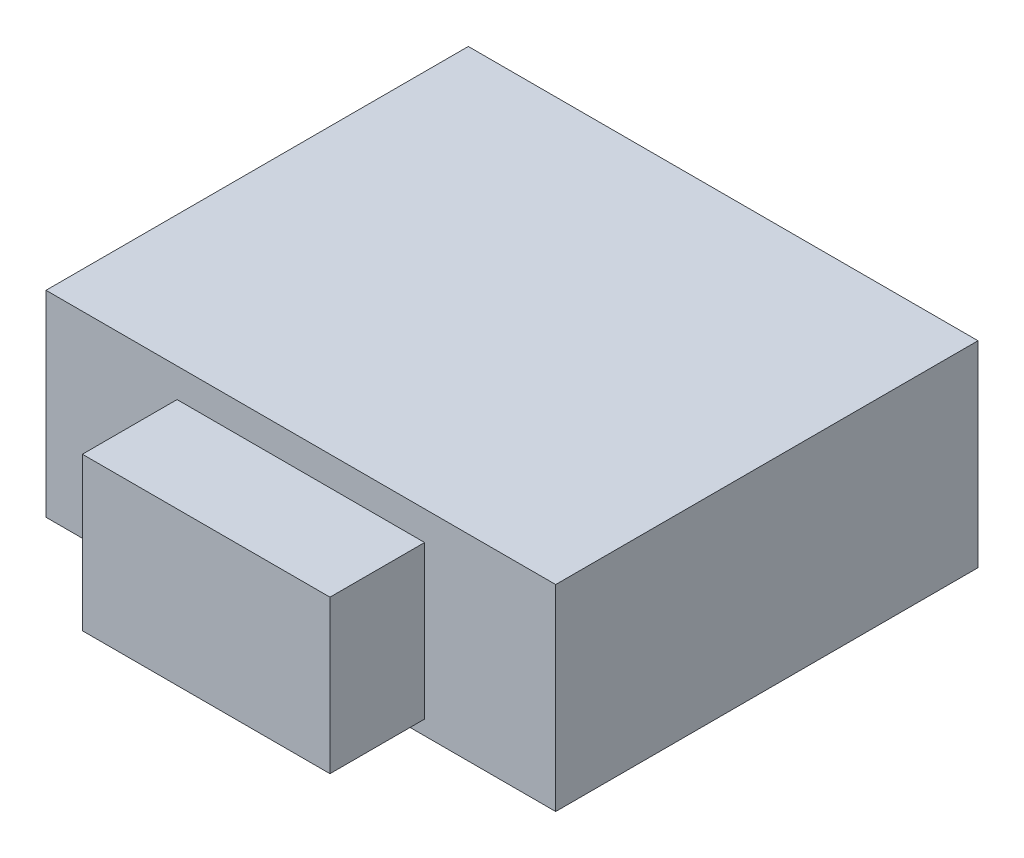
ISO-10303-21;
HEADER;
FILE_DESCRIPTION(('STEP AP214'),'2;1');
FILE_NAME('part.step','',(''),(''),'','','');
FILE_SCHEMA(('AUTOMOTIVE_DESIGN { 1 0 10303 214 1 1 1 1 }'));
ENDSEC;
DATA;
#1=APPLICATION_CONTEXT('core data for automotive mechanical design processes');
#2=APPLICATION_PROTOCOL_DEFINITION('international standard','automotive_design',2000,#1);
#3=PRODUCT_CONTEXT('',#1,'mechanical');
#4=PRODUCT('Part','Part','',(#3));
#5=PRODUCT_RELATED_PRODUCT_CATEGORY('part','',(#4));
#6=PRODUCT_DEFINITION_FORMATION('','',#4);
#7=PRODUCT_DEFINITION_CONTEXT('part definition',#1,'design');
#8=PRODUCT_DEFINITION('design','',#6,#7);
#9=PRODUCT_DEFINITION_SHAPE('','',#8);
#10=(LENGTH_UNIT() NAMED_UNIT(*) SI_UNIT(.MILLI.,.METRE.));
#11=(NAMED_UNIT(*) PLANE_ANGLE_UNIT() SI_UNIT($,.RADIAN.));
#12=(NAMED_UNIT(*) SI_UNIT($,.STERADIAN.) SOLID_ANGLE_UNIT());
#13=UNCERTAINTY_MEASURE_WITH_UNIT(LENGTH_MEASURE(1.E-05),#10,'distance_accuracy_value','');
#14=(GEOMETRIC_REPRESENTATION_CONTEXT(3) GLOBAL_UNCERTAINTY_ASSIGNED_CONTEXT((#13)) GLOBAL_UNIT_ASSIGNED_CONTEXT((#10,
#11,#12)) REPRESENTATION_CONTEXT('',''));
#15=CARTESIAN_POINT('',(0.,0.,0.));
#16=DIRECTION('',(0.,0.,1.));
#17=DIRECTION('',(1.,0.,0.));
#18=AXIS2_PLACEMENT_3D('',#15,#16,#17);
#19=CARTESIAN_POINT('',(0.,0.,0.));
#20=DIRECTION('',(0.,0.,1.));
#21=DIRECTION('',(1.,0.,0.));
#22=AXIS2_PLACEMENT_3D('',#19,#20,#21);
#23=PLANE('',#22);
#24=DIRECTION('',(0.,1.,0.));
#25=VECTOR('',#24,1.);
#26=CARTESIAN_POINT('',(-1.75,0.,0.));
#27=LINE('',#26,#25);
#28=CARTESIAN_POINT('',(-1.75,-1.34999999999999,0.));
#29=VERTEX_POINT('',#28);
#30=CARTESIAN_POINT('',(-1.75,0.,0.));
#31=VERTEX_POINT('',#30);
#32=EDGE_CURVE('E132',#29,#31,#27,.T.);
#33=ORIENTED_EDGE('',*,*,#32,.F.);
#34=DIRECTION('',(-1.,0.,0.));
#35=VECTOR('',#34,1.);
#36=CARTESIAN_POINT('',(-1.75,-1.34999999999999,0.));
#37=LINE('',#36,#35);
#38=CARTESIAN_POINT('',(1.75,-1.34999999999999,0.));
#39=VERTEX_POINT('',#38);
#40=EDGE_CURVE('E78',#39,#29,#37,.T.);
#41=ORIENTED_EDGE('',*,*,#40,.F.);
#42=DIRECTION('',(0.,-1.,0.));
#43=VECTOR('',#42,1.);
#44=CARTESIAN_POINT('',(1.75,0.,0.));
#45=LINE('',#44,#43);
#46=CARTESIAN_POINT('',(1.75,0.,0.));
#47=VERTEX_POINT('',#46);
#48=EDGE_CURVE('E148',#47,#39,#45,.T.);
#49=ORIENTED_EDGE('',*,*,#48,.F.);
#50=DIRECTION('',(1.,0.,0.));
#51=VECTOR('',#50,1.);
#52=CARTESIAN_POINT('',(-1.75,0.,0.));
#53=LINE('',#52,#51);
#54=EDGE_CURVE('E135',#31,#47,#53,.T.);
#55=ORIENTED_EDGE('',*,*,#54,.F.);
#56=EDGE_LOOP('',(#33,#41,#49,#55));
#57=FACE_BOUND('',#56,.T.);
#58=DIRECTION('',(1.,0.,0.));
#59=VECTOR('',#58,1.);
#60=CARTESIAN_POINT('',(0.85,-1.24999999999999,0.));
#61=LINE('',#60,#59);
#62=CARTESIAN_POINT('',(-0.85,-1.24999999999999,0.));
#63=VERTEX_POINT('',#62);
#64=CARTESIAN_POINT('',(0.85,-1.24999999999999,0.));
#65=VERTEX_POINT('',#64);
#66=EDGE_CURVE('E263',#63,#65,#61,.T.);
#67=ORIENTED_EDGE('',*,*,#66,.F.);
#68=DIRECTION('',(0.,-1.,0.));
#69=VECTOR('',#68,1.);
#70=CARTESIAN_POINT('',(-0.85,-1.24999999999999,0.));
#71=LINE('',#70,#69);
#72=CARTESIAN_POINT('',(-0.85,-0.199999999999992,0.));
#73=VERTEX_POINT('',#72);
#74=EDGE_CURVE('E130',#73,#63,#71,.T.);
#75=ORIENTED_EDGE('',*,*,#74,.F.);
#76=DIRECTION('',(-1.,0.,0.));
#77=VECTOR('',#76,1.);
#78=CARTESIAN_POINT('',(0.85,-0.199999999999992,0.));
#79=LINE('',#78,#77);
#80=CARTESIAN_POINT('',(0.85,-0.199999999999992,0.));
#81=VERTEX_POINT('',#80);
#82=EDGE_CURVE('E126',#81,#73,#79,.T.);
#83=ORIENTED_EDGE('',*,*,#82,.F.);
#84=DIRECTION('',(0.,1.,0.));
#85=VECTOR('',#84,1.);
#86=CARTESIAN_POINT('',(0.85,-1.24999999999999,0.));
#87=LINE('',#86,#85);
#88=EDGE_CURVE('E260',#65,#81,#87,.T.);
#89=ORIENTED_EDGE('',*,*,#88,.F.);
#90=EDGE_LOOP('',(#67,#75,#83,#89));
#91=FACE_BOUND('',#90,.T.);
#92=ADVANCED_FACE('F33',(#57,#91),#23,.T.);
#93=CARTESIAN_POINT('',(-1.75,0.,-2.9));
#94=DIRECTION('',(1.,0.,0.));
#95=DIRECTION('',(0.,0.,-1.));
#96=AXIS2_PLACEMENT_3D('',#93,#94,#95);
#97=PLANE('',#96);
#98=ORIENTED_EDGE('',*,*,#32,.T.);
#99=DIRECTION('',(0.,0.,1.));
#100=VECTOR('',#99,1.);
#101=CARTESIAN_POINT('',(-1.75,0.,-2.9));
#102=LINE('',#101,#100);
#103=CARTESIAN_POINT('',(-1.75,0.,-2.9));
#104=VERTEX_POINT('',#103);
#105=EDGE_CURVE('E11',#104,#31,#102,.T.);
#106=ORIENTED_EDGE('',*,*,#105,.F.);
#107=DIRECTION('',(0.,1.,0.));
#108=VECTOR('',#107,1.);
#109=CARTESIAN_POINT('',(-1.75,0.,-2.9));
#110=LINE('',#109,#108);
#111=CARTESIAN_POINT('',(-1.75,-1.34999999999999,-2.9));
#112=VERTEX_POINT('',#111);
#113=EDGE_CURVE('E140',#112,#104,#110,.T.);
#114=ORIENTED_EDGE('',*,*,#113,.F.);
#115=DIRECTION('',(0.,0.,1.));
#116=VECTOR('',#115,1.);
#117=CARTESIAN_POINT('',(-1.75,-1.34999999999999,-2.9));
#118=LINE('',#117,#116);
#119=EDGE_CURVE('E145',#112,#29,#118,.T.);
#120=ORIENTED_EDGE('',*,*,#119,.T.);
#121=EDGE_LOOP('',(#98,#106,#114,#120));
#122=FACE_BOUND('',#121,.T.);
#123=ADVANCED_FACE('F35',(#122),#97,.F.);
#124=CARTESIAN_POINT('',(-1.75,0.,-2.9));
#125=DIRECTION('',(0.,-1.,0.));
#126=DIRECTION('',(0.,0.,-1.));
#127=AXIS2_PLACEMENT_3D('',#124,#125,#126);
#128=PLANE('',#127);
#129=ORIENTED_EDGE('',*,*,#54,.T.);
#130=DIRECTION('',(0.,0.,1.));
#131=VECTOR('',#130,1.);
#132=CARTESIAN_POINT('',(1.75,0.,-2.9));
#133=LINE('',#132,#131);
#134=CARTESIAN_POINT('',(1.75,0.,-2.9));
#135=VERTEX_POINT('',#134);
#136=EDGE_CURVE('E41',#135,#47,#133,.T.);
#137=ORIENTED_EDGE('',*,*,#136,.F.);
#138=DIRECTION('',(1.,0.,0.));
#139=VECTOR('',#138,1.);
#140=CARTESIAN_POINT('',(-1.75,0.,-2.9));
#141=LINE('',#140,#139);
#142=EDGE_CURVE('E85',#104,#135,#141,.T.);
#143=ORIENTED_EDGE('',*,*,#142,.F.);
#144=ORIENTED_EDGE('',*,*,#105,.T.);
#145=EDGE_LOOP('',(#129,#137,#143,#144));
#146=FACE_BOUND('',#145,.T.);
#147=ADVANCED_FACE('F174',(#146),#128,.F.);
#148=CARTESIAN_POINT('',(1.75,0.,-2.9));
#149=DIRECTION('',(-1.,0.,0.));
#150=DIRECTION('',(0.,-1.,0.));
#151=AXIS2_PLACEMENT_3D('',#148,#149,#150);
#152=PLANE('',#151);
#153=ORIENTED_EDGE('',*,*,#48,.T.);
#154=DIRECTION('',(0.,0.,1.));
#155=VECTOR('',#154,1.);
#156=CARTESIAN_POINT('',(1.75,-1.34999999999999,-2.9));
#157=LINE('',#156,#155);
#158=CARTESIAN_POINT('',(1.75,-1.34999999999999,-2.9));
#159=VERTEX_POINT('',#158);
#160=EDGE_CURVE('E152',#159,#39,#157,.T.);
#161=ORIENTED_EDGE('',*,*,#160,.F.);
#162=DIRECTION('',(0.,-1.,0.));
#163=VECTOR('',#162,1.);
#164=CARTESIAN_POINT('',(1.75,0.,-2.9));
#165=LINE('',#164,#163);
#166=EDGE_CURVE('E143',#135,#159,#165,.T.);
#167=ORIENTED_EDGE('',*,*,#166,.F.);
#168=ORIENTED_EDGE('',*,*,#136,.T.);
#169=EDGE_LOOP('',(#153,#161,#167,#168));
#170=FACE_BOUND('',#169,.T.);
#171=ADVANCED_FACE('F157',(#170),#152,.F.);
#172=CARTESIAN_POINT('',(-1.75,-1.34999999999999,-2.9));
#173=DIRECTION('',(0.,1.,0.));
#174=DIRECTION('',(0.,0.,1.));
#175=AXIS2_PLACEMENT_3D('',#172,#173,#174);
#176=PLANE('',#175);
#177=ORIENTED_EDGE('',*,*,#40,.T.);
#178=ORIENTED_EDGE('',*,*,#119,.F.);
#179=DIRECTION('',(-1.,0.,0.));
#180=VECTOR('',#179,1.);
#181=CARTESIAN_POINT('',(-1.75,-1.34999999999999,-2.9));
#182=LINE('',#181,#180);
#183=EDGE_CURVE('E57',#159,#112,#182,.T.);
#184=ORIENTED_EDGE('',*,*,#183,.F.);
#185=ORIENTED_EDGE('',*,*,#160,.T.);
#186=EDGE_LOOP('',(#177,#178,#184,#185));
#187=FACE_BOUND('',#186,.T.);
#188=ADVANCED_FACE('F165',(#187),#176,.F.);
#189=CARTESIAN_POINT('',(0.,0.,-2.9));
#190=DIRECTION('',(0.,0.,1.));
#191=DIRECTION('',(1.,0.,0.));
#192=AXIS2_PLACEMENT_3D('',#189,#190,#191);
#193=PLANE('',#192);
#194=ORIENTED_EDGE('',*,*,#113,.T.);
#195=ORIENTED_EDGE('',*,*,#142,.T.);
#196=ORIENTED_EDGE('',*,*,#166,.T.);
#197=ORIENTED_EDGE('',*,*,#183,.T.);
#198=EDGE_LOOP('',(#194,#195,#196,#197));
#199=FACE_BOUND('',#198,.T.);
#200=ADVANCED_FACE('F167',(#199),#193,.F.);
#201=CARTESIAN_POINT('',(-0.85,-1.24999999999999,0.65));
#202=DIRECTION('',(1.,0.,0.));
#203=DIRECTION('',(0.,0.,-1.));
#204=AXIS2_PLACEMENT_3D('',#201,#202,#203);
#205=PLANE('',#204);
#206=ORIENTED_EDGE('',*,*,#74,.T.);
#207=DIRECTION('',(0.,0.,-1.));
#208=VECTOR('',#207,1.);
#209=CARTESIAN_POINT('',(-0.85,-1.24999999999999,0.65));
#210=LINE('',#209,#208);
#211=CARTESIAN_POINT('',(-0.85,-1.24999999999999,0.65));
#212=VERTEX_POINT('',#211);
#213=EDGE_CURVE('E111',#212,#63,#210,.T.);
#214=ORIENTED_EDGE('',*,*,#213,.F.);
#215=DIRECTION('',(0.,-1.,0.));
#216=VECTOR('',#215,1.);
#217=CARTESIAN_POINT('',(-0.85,-1.24999999999999,0.65));
#218=LINE('',#217,#216);
#219=CARTESIAN_POINT('',(-0.85,-0.199999999999992,0.65));
#220=VERTEX_POINT('',#219);
#221=EDGE_CURVE('E118',#220,#212,#218,.T.);
#222=ORIENTED_EDGE('',*,*,#221,.F.);
#223=DIRECTION('',(0.,0.,-1.));
#224=VECTOR('',#223,1.);
#225=CARTESIAN_POINT('',(-0.85,-0.199999999999992,0.65));
#226=LINE('',#225,#224);
#227=EDGE_CURVE('E258',#220,#73,#226,.T.);
#228=ORIENTED_EDGE('',*,*,#227,.T.);
#229=EDGE_LOOP('',(#206,#214,#222,#228));
#230=FACE_BOUND('',#229,.T.);
#231=ADVANCED_FACE('F128',(#230),#205,.F.);
#232=CARTESIAN_POINT('',(0.85,-1.24999999999999,0.65));
#233=DIRECTION('',(0.,1.,0.));
#234=DIRECTION('',(-1.,0.,0.));
#235=AXIS2_PLACEMENT_3D('',#232,#233,#234);
#236=PLANE('',#235);
#237=ORIENTED_EDGE('',*,*,#66,.T.);
#238=DIRECTION('',(0.,0.,-1.));
#239=VECTOR('',#238,1.);
#240=CARTESIAN_POINT('',(0.85,-1.24999999999999,0.65));
#241=LINE('',#240,#239);
#242=CARTESIAN_POINT('',(0.85,-1.24999999999999,0.65));
#243=VERTEX_POINT('',#242);
#244=EDGE_CURVE('E114',#243,#65,#241,.T.);
#245=ORIENTED_EDGE('',*,*,#244,.F.);
#246=DIRECTION('',(1.,0.,0.));
#247=VECTOR('',#246,1.);
#248=CARTESIAN_POINT('',(0.85,-1.24999999999999,0.65));
#249=LINE('',#248,#247);
#250=EDGE_CURVE('E107',#212,#243,#249,.T.);
#251=ORIENTED_EDGE('',*,*,#250,.F.);
#252=ORIENTED_EDGE('',*,*,#213,.T.);
#253=EDGE_LOOP('',(#237,#245,#251,#252));
#254=FACE_BOUND('',#253,.T.);
#255=ADVANCED_FACE('F109',(#254),#236,.F.);
#256=CARTESIAN_POINT('',(0.85,-1.24999999999999,0.65));
#257=DIRECTION('',(-1.,0.,0.));
#258=DIRECTION('',(0.,0.,1.));
#259=AXIS2_PLACEMENT_3D('',#256,#257,#258);
#260=PLANE('',#259);
#261=ORIENTED_EDGE('',*,*,#88,.T.);
#262=DIRECTION('',(0.,0.,-1.));
#263=VECTOR('',#262,1.);
#264=CARTESIAN_POINT('',(0.85,-0.199999999999992,0.65));
#265=LINE('',#264,#263);
#266=CARTESIAN_POINT('',(0.85,-0.199999999999992,0.65));
#267=VERTEX_POINT('',#266);
#268=EDGE_CURVE('E48',#267,#81,#265,.T.);
#269=ORIENTED_EDGE('',*,*,#268,.F.);
#270=DIRECTION('',(0.,1.,0.));
#271=VECTOR('',#270,1.);
#272=CARTESIAN_POINT('',(0.85,-1.24999999999999,0.65));
#273=LINE('',#272,#271);
#274=EDGE_CURVE('E117',#243,#267,#273,.T.);
#275=ORIENTED_EDGE('',*,*,#274,.F.);
#276=ORIENTED_EDGE('',*,*,#244,.T.);
#277=EDGE_LOOP('',(#261,#269,#275,#276));
#278=FACE_BOUND('',#277,.T.);
#279=ADVANCED_FACE('F186',(#278),#260,.F.);
#280=CARTESIAN_POINT('',(0.85,-0.199999999999992,0.65));
#281=DIRECTION('',(0.,-1.,0.));
#282=DIRECTION('',(1.,0.,0.));
#283=AXIS2_PLACEMENT_3D('',#280,#281,#282);
#284=PLANE('',#283);
#285=ORIENTED_EDGE('',*,*,#82,.T.);
#286=ORIENTED_EDGE('',*,*,#227,.F.);
#287=DIRECTION('',(-1.,0.,0.));
#288=VECTOR('',#287,1.);
#289=CARTESIAN_POINT('',(0.85,-0.199999999999992,0.65));
#290=LINE('',#289,#288);
#291=EDGE_CURVE('E122',#267,#220,#290,.T.);
#292=ORIENTED_EDGE('',*,*,#291,.F.);
#293=ORIENTED_EDGE('',*,*,#268,.T.);
#294=EDGE_LOOP('',(#285,#286,#292,#293));
#295=FACE_BOUND('',#294,.T.);
#296=ADVANCED_FACE('F189',(#295),#284,.F.);
#297=CARTESIAN_POINT('',(0.,0.,0.65));
#298=DIRECTION('',(0.,0.,1.));
#299=DIRECTION('',(1.,0.,0.));
#300=AXIS2_PLACEMENT_3D('',#297,#298,#299);
#301=PLANE('',#300);
#302=ORIENTED_EDGE('',*,*,#221,.T.);
#303=ORIENTED_EDGE('',*,*,#250,.T.);
#304=ORIENTED_EDGE('',*,*,#274,.T.);
#305=ORIENTED_EDGE('',*,*,#291,.T.);
#306=EDGE_LOOP('',(#302,#303,#304,#305));
#307=FACE_BOUND('',#306,.T.);
#308=ADVANCED_FACE('F121',(#307),#301,.T.);
#309=CLOSED_SHELL('',(#92,#123,#147,#171,#188,#200,#231,#255,#279,#296,#308));
#310=MANIFOLD_SOLID_BREP('B2',#309);
#311=ADVANCED_BREP_SHAPE_REPRESENTATION('',(#18,#310),#14);
#312=SHAPE_DEFINITION_REPRESENTATION(#9,#311);
ENDSEC;
END-ISO-10303-21;
